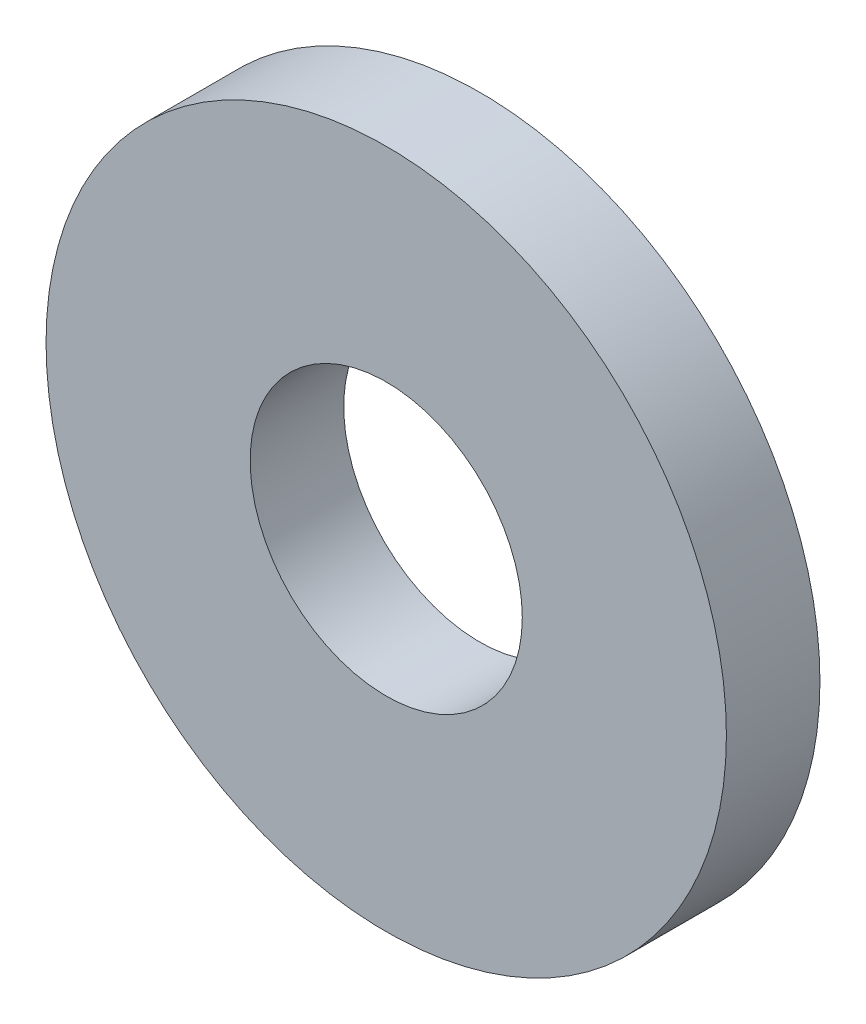
ISO-10303-21;
HEADER;
FILE_DESCRIPTION(('STEP AP214'),'2;1');
FILE_NAME('part.step','',(''),(''),'','','');
FILE_SCHEMA(('AUTOMOTIVE_DESIGN { 1 0 10303 214 1 1 1 1 }'));
ENDSEC;
DATA;
#1=APPLICATION_CONTEXT('core data for automotive mechanical design processes');
#2=APPLICATION_PROTOCOL_DEFINITION('international standard','automotive_design',2000,#1);
#3=PRODUCT_CONTEXT('',#1,'mechanical');
#4=PRODUCT('Part','Part','',(#3));
#5=PRODUCT_RELATED_PRODUCT_CATEGORY('part','',(#4));
#6=PRODUCT_DEFINITION_FORMATION('','',#4);
#7=PRODUCT_DEFINITION_CONTEXT('part definition',#1,'design');
#8=PRODUCT_DEFINITION('design','',#6,#7);
#9=PRODUCT_DEFINITION_SHAPE('','',#8);
#10=(LENGTH_UNIT() NAMED_UNIT(*) SI_UNIT(.MILLI.,.METRE.));
#11=(NAMED_UNIT(*) PLANE_ANGLE_UNIT() SI_UNIT($,.RADIAN.));
#12=(NAMED_UNIT(*) SI_UNIT($,.STERADIAN.) SOLID_ANGLE_UNIT());
#13=UNCERTAINTY_MEASURE_WITH_UNIT(LENGTH_MEASURE(1.E-05),#10,'distance_accuracy_value','');
#14=(GEOMETRIC_REPRESENTATION_CONTEXT(3) GLOBAL_UNCERTAINTY_ASSIGNED_CONTEXT((#13)) GLOBAL_UNIT_ASSIGNED_CONTEXT((#10,
#11,#12)) REPRESENTATION_CONTEXT('',''));
#15=CARTESIAN_POINT('',(0.,0.,0.));
#16=DIRECTION('',(0.,0.,1.));
#17=DIRECTION('',(1.,0.,0.));
#18=AXIS2_PLACEMENT_3D('',#15,#16,#17);
#19=CARTESIAN_POINT('',(0.,0.,1.1));
#20=DIRECTION('',(0.,0.,1.));
#21=DIRECTION('',(1.,0.,0.));
#22=AXIS2_PLACEMENT_3D('',#19,#20,#21);
#23=PLANE('',#22);
#24=CARTESIAN_POINT('',(0.,0.,1.1));
#25=DIRECTION('',(0.,0.,1.));
#26=DIRECTION('',(1.,0.,0.));
#27=AXIS2_PLACEMENT_3D('',#24,#25,#26);
#28=CIRCLE('',#27,4.);
#29=CARTESIAN_POINT('',(4.,0.,1.1));
#30=VERTEX_POINT('',#29);
#31=EDGE_CURVE('E10',#30,#30,#28,.T.);
#32=ORIENTED_EDGE('',*,*,#31,.T.);
#33=EDGE_LOOP('',(#32));
#34=FACE_BOUND('',#33,.T.);
#35=CARTESIAN_POINT('',(0.,0.,1.1));
#36=DIRECTION('',(0.,0.,1.));
#37=DIRECTION('',(1.,0.,0.));
#38=AXIS2_PLACEMENT_3D('',#35,#36,#37);
#39=CIRCLE('',#38,1.6);
#40=CARTESIAN_POINT('',(1.6,0.,1.1));
#41=VERTEX_POINT('',#40);
#42=EDGE_CURVE('E48',#41,#41,#39,.T.);
#43=ORIENTED_EDGE('',*,*,#42,.F.);
#44=EDGE_LOOP('',(#43));
#45=FACE_BOUND('',#44,.T.);
#46=ADVANCED_FACE('F34',(#34,#45),#23,.T.);
#47=CARTESIAN_POINT('',(0.,0.,0.));
#48=DIRECTION('',(0.,0.,1.));
#49=DIRECTION('',(1.,0.,0.));
#50=AXIS2_PLACEMENT_3D('',#47,#48,#49);
#51=PLANE('',#50);
#52=CARTESIAN_POINT('',(0.,0.,0.));
#53=DIRECTION('',(0.,0.,1.));
#54=DIRECTION('',(1.,0.,0.));
#55=AXIS2_PLACEMENT_3D('',#52,#53,#54);
#56=CIRCLE('',#55,4.);
#57=CARTESIAN_POINT('',(4.,0.,0.));
#58=VERTEX_POINT('',#57);
#59=EDGE_CURVE('E38',#58,#58,#56,.T.);
#60=ORIENTED_EDGE('',*,*,#59,.F.);
#61=EDGE_LOOP('',(#60));
#62=FACE_BOUND('',#61,.T.);
#63=CARTESIAN_POINT('',(0.,0.,0.));
#64=DIRECTION('',(0.,0.,1.));
#65=DIRECTION('',(1.,0.,0.));
#66=AXIS2_PLACEMENT_3D('',#63,#64,#65);
#67=CIRCLE('',#66,1.6);
#68=CARTESIAN_POINT('',(1.6,0.,0.));
#69=VERTEX_POINT('',#68);
#70=EDGE_CURVE('E50',#69,#69,#67,.T.);
#71=ORIENTED_EDGE('',*,*,#70,.T.);
#72=EDGE_LOOP('',(#71));
#73=FACE_BOUND('',#72,.T.);
#74=ADVANCED_FACE('F61',(#62,#73),#51,.F.);
#75=CARTESIAN_POINT('',(0.,0.,1.1));
#76=DIRECTION('',(0.,0.,-1.));
#77=DIRECTION('',(-1.,0.,0.));
#78=AXIS2_PLACEMENT_3D('',#75,#76,#77);
#79=CYLINDRICAL_SURFACE('',#78,4.);
#80=ORIENTED_EDGE('',*,*,#31,.F.);
#81=EDGE_LOOP('',(#80));
#82=FACE_BOUND('',#81,.T.);
#83=ORIENTED_EDGE('',*,*,#59,.T.);
#84=EDGE_LOOP('',(#83));
#85=FACE_BOUND('',#84,.T.);
#86=ADVANCED_FACE('F36',(#82,#85),#79,.T.);
#87=CARTESIAN_POINT('',(0.,0.,1.1));
#88=DIRECTION('',(0.,0.,-1.));
#89=DIRECTION('',(-1.,0.,0.));
#90=AXIS2_PLACEMENT_3D('',#87,#88,#89);
#91=CYLINDRICAL_SURFACE('',#90,1.6);
#92=ORIENTED_EDGE('',*,*,#42,.T.);
#93=EDGE_LOOP('',(#92));
#94=FACE_BOUND('',#93,.T.);
#95=ORIENTED_EDGE('',*,*,#70,.F.);
#96=EDGE_LOOP('',(#95));
#97=FACE_BOUND('',#96,.T.);
#98=ADVANCED_FACE('F57',(#94,#97),#91,.F.);
#99=CLOSED_SHELL('',(#46,#74,#86,#98));
#100=MANIFOLD_SOLID_BREP('B2',#99);
#101=ADVANCED_BREP_SHAPE_REPRESENTATION('',(#18,#100),#14);
#102=SHAPE_DEFINITION_REPRESENTATION(#9,#101);
ENDSEC;
END-ISO-10303-21;
